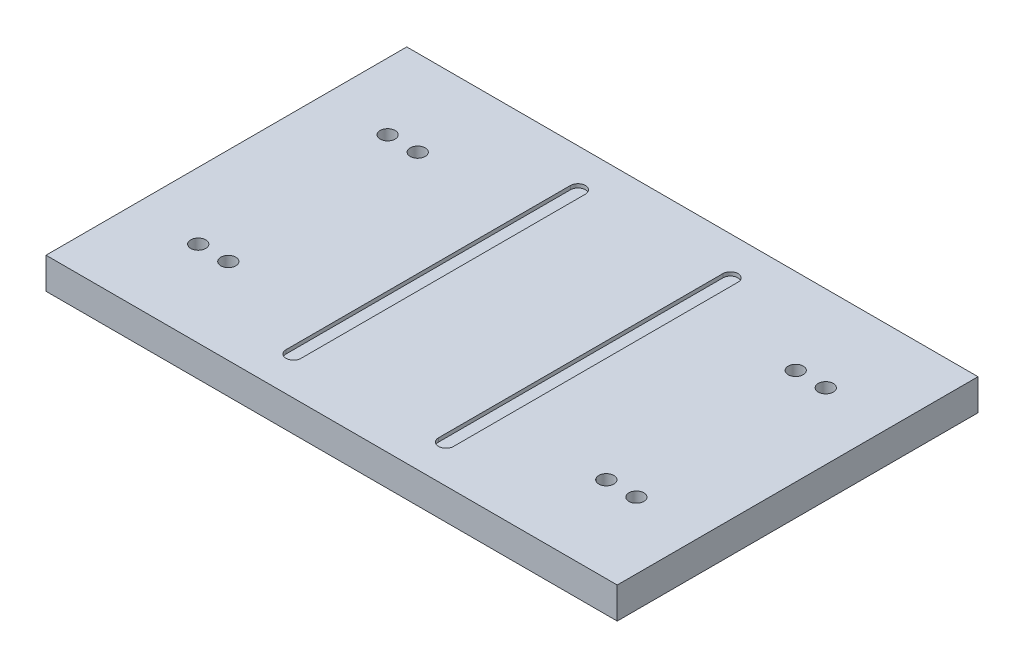
ISO-10303-21;
HEADER;
FILE_DESCRIPTION(('STEP AP214'),'2;1');
FILE_NAME('part.step','',(''),(''),'','','');
FILE_SCHEMA(('AUTOMOTIVE_DESIGN { 1 0 10303 214 1 1 1 1 }'));
ENDSEC;
DATA;
#1=APPLICATION_CONTEXT('core data for automotive mechanical design processes');
#2=APPLICATION_PROTOCOL_DEFINITION('international standard','automotive_design',2000,#1);
#3=PRODUCT_CONTEXT('',#1,'mechanical');
#4=PRODUCT('Part','Part','',(#3));
#5=PRODUCT_RELATED_PRODUCT_CATEGORY('part','',(#4));
#6=PRODUCT_DEFINITION_FORMATION('','',#4);
#7=PRODUCT_DEFINITION_CONTEXT('part definition',#1,'design');
#8=PRODUCT_DEFINITION('design','',#6,#7);
#9=PRODUCT_DEFINITION_SHAPE('','',#8);
#10=(LENGTH_UNIT() NAMED_UNIT(*) SI_UNIT(.MILLI.,.METRE.));
#11=(NAMED_UNIT(*) PLANE_ANGLE_UNIT() SI_UNIT($,.RADIAN.));
#12=(NAMED_UNIT(*) SI_UNIT($,.STERADIAN.) SOLID_ANGLE_UNIT());
#13=UNCERTAINTY_MEASURE_WITH_UNIT(LENGTH_MEASURE(1.E-05),#10,'distance_accuracy_value','');
#14=(GEOMETRIC_REPRESENTATION_CONTEXT(3) GLOBAL_UNCERTAINTY_ASSIGNED_CONTEXT((#13)) GLOBAL_UNIT_ASSIGNED_CONTEXT((#10,
#11,#12)) REPRESENTATION_CONTEXT('',''));
#15=CARTESIAN_POINT('',(0.,0.,0.));
#16=DIRECTION('',(0.,0.,1.));
#17=DIRECTION('',(1.,0.,0.));
#18=AXIS2_PLACEMENT_3D('',#15,#16,#17);
#19=CARTESIAN_POINT('',(0.,26.416,0.));
#20=DIRECTION('',(0.,-1.,0.));
#21=DIRECTION('',(0.,0.,-1.));
#22=AXIS2_PLACEMENT_3D('',#19,#20,#21);
#23=PLANE('',#22);
#24=CARTESIAN_POINT('',(159.6865,26.416,80.01));
#25=DIRECTION('',(0.,1.,0.));
#26=DIRECTION('',(0.,0.,-1.));
#27=AXIS2_PLACEMENT_3D('',#24,#25,#26);
#28=CIRCLE('',#27,6.34999999999999);
#29=CARTESIAN_POINT('',(159.6865,26.416,73.66));
#30=VERTEX_POINT('',#29);
#31=EDGE_CURVE('E584',#30,#30,#28,.T.);
#32=ORIENTED_EDGE('',*,*,#31,.F.);
#33=EDGE_LOOP('',(#32));
#34=FACE_BOUND('',#33,.T.);
#35=CARTESIAN_POINT('',(-185.0865,26.416,-80.01));
#36=DIRECTION('',(0.,1.,0.));
#37=DIRECTION('',(0.,0.,-1.));
#38=AXIS2_PLACEMENT_3D('',#35,#36,#37);
#39=CIRCLE('',#38,6.34999999999999);
#40=CARTESIAN_POINT('',(-185.0865,26.416,-86.36));
#41=VERTEX_POINT('',#40);
#42=EDGE_CURVE('E591',#41,#41,#39,.T.);
#43=ORIENTED_EDGE('',*,*,#42,.F.);
#44=EDGE_LOOP('',(#43));
#45=FACE_BOUND('',#44,.T.);
#46=CARTESIAN_POINT('',(-159.6865,26.416,-80.01));
#47=DIRECTION('',(0.,1.,0.));
#48=DIRECTION('',(0.,0.,-1.));
#49=AXIS2_PLACEMENT_3D('',#46,#47,#48);
#50=CIRCLE('',#49,6.34999999999999);
#51=CARTESIAN_POINT('',(-159.6865,26.416,-86.36));
#52=VERTEX_POINT('',#51);
#53=EDGE_CURVE('E605',#52,#52,#50,.T.);
#54=ORIENTED_EDGE('',*,*,#53,.F.);
#55=EDGE_LOOP('',(#54));
#56=FACE_BOUND('',#55,.T.);
#57=CARTESIAN_POINT('',(-159.6865,26.416,80.01));
#58=DIRECTION('',(0.,1.,0.));
#59=DIRECTION('',(0.,0.,1.));
#60=AXIS2_PLACEMENT_3D('',#57,#58,#59);
#61=CIRCLE('',#60,6.34999999999999);
#62=CARTESIAN_POINT('',(-159.6865,26.416,86.36));
#63=VERTEX_POINT('',#62);
#64=EDGE_CURVE('E597',#63,#63,#61,.T.);
#65=ORIENTED_EDGE('',*,*,#64,.F.);
#66=EDGE_LOOP('',(#65));
#67=FACE_BOUND('',#66,.T.);
#68=CARTESIAN_POINT('',(185.0865,26.416,-80.01));
#69=DIRECTION('',(0.,1.,0.));
#70=DIRECTION('',(0.,0.,1.));
#71=AXIS2_PLACEMENT_3D('',#68,#69,#70);
#72=CIRCLE('',#71,6.34999999999999);
#73=CARTESIAN_POINT('',(185.0865,26.416,-73.66));
#74=VERTEX_POINT('',#73);
#75=EDGE_CURVE('E634',#74,#74,#72,.T.);
#76=ORIENTED_EDGE('',*,*,#75,.F.);
#77=EDGE_LOOP('',(#76));
#78=FACE_BOUND('',#77,.T.);
#79=CARTESIAN_POINT('',(159.6865,26.416,-80.01));
#80=DIRECTION('',(0.,1.,0.));
#81=DIRECTION('',(0.,0.,1.));
#82=AXIS2_PLACEMENT_3D('',#79,#80,#81);
#83=CIRCLE('',#82,6.34999999999999);
#84=CARTESIAN_POINT('',(159.6865,26.416,-73.66));
#85=VERTEX_POINT('',#84);
#86=EDGE_CURVE('E633',#85,#85,#83,.T.);
#87=ORIENTED_EDGE('',*,*,#86,.F.);
#88=EDGE_LOOP('',(#87));
#89=FACE_BOUND('',#88,.T.);
#90=CARTESIAN_POINT('',(185.0865,26.416,80.01));
#91=DIRECTION('',(0.,1.,0.));
#92=DIRECTION('',(0.,0.,-1.));
#93=AXIS2_PLACEMENT_3D('',#90,#91,#92);
#94=CIRCLE('',#93,6.34999999999999);
#95=CARTESIAN_POINT('',(185.0865,26.416,73.66));
#96=VERTEX_POINT('',#95);
#97=EDGE_CURVE('E593',#96,#96,#94,.T.);
#98=ORIENTED_EDGE('',*,*,#97,.F.);
#99=EDGE_LOOP('',(#98));
#100=FACE_BOUND('',#99,.T.);
#101=CARTESIAN_POINT('',(-185.0865,26.416,80.01));
#102=DIRECTION('',(0.,1.,0.));
#103=DIRECTION('',(0.,0.,1.));
#104=AXIS2_PLACEMENT_3D('',#101,#102,#103);
#105=CIRCLE('',#104,6.34999999999999);
#106=CARTESIAN_POINT('',(-185.0865,26.416,86.36));
#107=VERTEX_POINT('',#106);
#108=EDGE_CURVE('E164',#107,#107,#105,.T.);
#109=ORIENTED_EDGE('',*,*,#108,.F.);
#110=EDGE_LOOP('',(#109));
#111=FACE_BOUND('',#110,.T.);
#112=DIRECTION('',(0.,0.,-1.));
#113=VECTOR('',#112,1.);
#114=CARTESIAN_POINT('',(-70.7865,26.416,0.));
#115=LINE('',#114,#113);
#116=CARTESIAN_POINT('',(-70.7865,26.416,120.142));
#117=VERTEX_POINT('',#116);
#118=CARTESIAN_POINT('',(-70.7865,26.416,-120.142));
#119=VERTEX_POINT('',#118);
#120=EDGE_CURVE('E173',#117,#119,#115,.T.);
#121=ORIENTED_EDGE('',*,*,#120,.T.);
#122=CARTESIAN_POINT('',(-64.4365,26.416,-120.142));
#123=DIRECTION('',(0.,1.,0.));
#124=DIRECTION('',(0.,0.,1.));
#125=AXIS2_PLACEMENT_3D('',#122,#123,#124);
#126=CIRCLE('',#125,6.35);
#127=CARTESIAN_POINT('',(-58.0865,26.416,-120.142));
#128=VERTEX_POINT('',#127);
#129=EDGE_CURVE('E59',#128,#119,#126,.T.);
#130=ORIENTED_EDGE('',*,*,#129,.F.);
#131=DIRECTION('',(0.,0.,-1.));
#132=VECTOR('',#131,1.);
#133=CARTESIAN_POINT('',(-58.0865,26.416,0.));
#134=LINE('',#133,#132);
#135=CARTESIAN_POINT('',(-58.0865,26.416,120.142));
#136=VERTEX_POINT('',#135);
#137=EDGE_CURVE('E157',#136,#128,#134,.T.);
#138=ORIENTED_EDGE('',*,*,#137,.F.);
#139=CARTESIAN_POINT('',(-64.4365,26.416,120.142));
#140=DIRECTION('',(0.,1.,0.));
#141=DIRECTION('',(0.,0.,1.));
#142=AXIS2_PLACEMENT_3D('',#139,#140,#141);
#143=CIRCLE('',#142,6.35);
#144=EDGE_CURVE('E161',#136,#117,#143,.F.);
#145=ORIENTED_EDGE('',*,*,#144,.T.);
#146=EDGE_LOOP('',(#121,#130,#138,#145));
#147=FACE_BOUND('',#146,.T.);
#148=DIRECTION('',(0.,0.,-1.));
#149=VECTOR('',#148,1.);
#150=CARTESIAN_POINT('',(241.3,26.416,152.4));
#151=LINE('',#150,#149);
#152=CARTESIAN_POINT('',(241.3,26.416,152.4));
#153=VERTEX_POINT('',#152);
#154=CARTESIAN_POINT('',(241.3,26.416,-152.4));
#155=VERTEX_POINT('',#154);
#156=EDGE_CURVE('E229',#153,#155,#151,.T.);
#157=ORIENTED_EDGE('',*,*,#156,.T.);
#158=DIRECTION('',(-1.,0.,0.));
#159=VECTOR('',#158,1.);
#160=CARTESIAN_POINT('',(-241.3,26.416,-152.4));
#161=LINE('',#160,#159);
#162=CARTESIAN_POINT('',(-241.3,26.416,-152.4));
#163=VERTEX_POINT('',#162);
#164=EDGE_CURVE('E233',#155,#163,#161,.T.);
#165=ORIENTED_EDGE('',*,*,#164,.T.);
#166=DIRECTION('',(0.,0.,1.));
#167=VECTOR('',#166,1.);
#168=CARTESIAN_POINT('',(-241.3,26.416,152.4));
#169=LINE('',#168,#167);
#170=CARTESIAN_POINT('',(-241.3,26.416,152.4));
#171=VERTEX_POINT('',#170);
#172=EDGE_CURVE('E237',#163,#171,#169,.T.);
#173=ORIENTED_EDGE('',*,*,#172,.T.);
#174=DIRECTION('',(1.,0.,0.));
#175=VECTOR('',#174,1.);
#176=CARTESIAN_POINT('',(-241.3,26.416,152.4));
#177=LINE('',#176,#175);
#178=EDGE_CURVE('E240',#171,#153,#177,.T.);
#179=ORIENTED_EDGE('',*,*,#178,.T.);
#180=EDGE_LOOP('',(#157,#165,#173,#179));
#181=FACE_BOUND('',#180,.T.);
#182=CARTESIAN_POINT('',(64.4365,26.416,-120.142));
#183=DIRECTION('',(0.,1.,0.));
#184=DIRECTION('',(0.,0.,1.));
#185=AXIS2_PLACEMENT_3D('',#182,#183,#184);
#186=CIRCLE('',#185,6.34999999999999);
#187=CARTESIAN_POINT('',(58.0865000000001,26.416,-120.142));
#188=VERTEX_POINT('',#187);
#189=CARTESIAN_POINT('',(70.7865,26.416,-120.142));
#190=VERTEX_POINT('',#189);
#191=EDGE_CURVE('E67',#188,#190,#186,.F.);
#192=ORIENTED_EDGE('',*,*,#191,.T.);
#193=DIRECTION('',(0.,0.,-1.));
#194=VECTOR('',#193,1.);
#195=CARTESIAN_POINT('',(70.7865,26.416,0.));
#196=LINE('',#195,#194);
#197=CARTESIAN_POINT('',(70.7865,26.416,120.142));
#198=VERTEX_POINT('',#197);
#199=EDGE_CURVE('E202',#198,#190,#196,.T.);
#200=ORIENTED_EDGE('',*,*,#199,.F.);
#201=CARTESIAN_POINT('',(64.4365000000001,26.416,120.142));
#202=DIRECTION('',(0.,1.,0.));
#203=DIRECTION('',(0.,0.,1.));
#204=AXIS2_PLACEMENT_3D('',#201,#202,#203);
#205=CIRCLE('',#204,6.34999999999999);
#206=CARTESIAN_POINT('',(58.0865000000001,26.416,120.142));
#207=VERTEX_POINT('',#206);
#208=EDGE_CURVE('E206',#207,#198,#205,.T.);
#209=ORIENTED_EDGE('',*,*,#208,.F.);
#210=DIRECTION('',(0.,0.,-1.));
#211=VECTOR('',#210,1.);
#212=CARTESIAN_POINT('',(58.0865000000001,26.416,0.));
#213=LINE('',#212,#211);
#214=EDGE_CURVE('E211',#207,#188,#213,.T.);
#215=ORIENTED_EDGE('',*,*,#214,.T.);
#216=EDGE_LOOP('',(#192,#200,#209,#215));
#217=FACE_BOUND('',#216,.T.);
#218=ADVANCED_FACE('F43',(#34,#45,#56,#67,#78,#89,#100,#111,#147,#181,#217),#23,.F.);
#219=CARTESIAN_POINT('',(241.3,26.416,152.4));
#220=DIRECTION('',(-1.,0.,0.));
#221=DIRECTION('',(0.,0.,1.));
#222=AXIS2_PLACEMENT_3D('',#219,#220,#221);
#223=PLANE('',#222);
#224=DIRECTION('',(0.,0.,-1.));
#225=VECTOR('',#224,1.);
#226=CARTESIAN_POINT('',(241.3,0.,152.4));
#227=LINE('',#226,#225);
#228=CARTESIAN_POINT('',(241.3,0.,152.4));
#229=VERTEX_POINT('',#228);
#230=CARTESIAN_POINT('',(241.3,0.,-152.4));
#231=VERTEX_POINT('',#230);
#232=EDGE_CURVE('E182',#229,#231,#227,.T.);
#233=ORIENTED_EDGE('',*,*,#232,.T.);
#234=DIRECTION('',(0.,-1.,0.));
#235=VECTOR('',#234,1.);
#236=CARTESIAN_POINT('',(241.3,26.416,-152.4));
#237=LINE('',#236,#235);
#238=EDGE_CURVE('E11',#155,#231,#237,.T.);
#239=ORIENTED_EDGE('',*,*,#238,.F.);
#240=ORIENTED_EDGE('',*,*,#156,.F.);
#241=DIRECTION('',(0.,-1.,0.));
#242=VECTOR('',#241,1.);
#243=CARTESIAN_POINT('',(241.3,26.416,152.4));
#244=LINE('',#243,#242);
#245=EDGE_CURVE('E243',#153,#229,#244,.T.);
#246=ORIENTED_EDGE('',*,*,#245,.T.);
#247=EDGE_LOOP('',(#233,#239,#240,#246));
#248=FACE_BOUND('',#247,.T.);
#249=ADVANCED_FACE('F45',(#248),#223,.F.);
#250=CARTESIAN_POINT('',(-241.3,26.416,-152.4));
#251=DIRECTION('',(0.,0.,1.));
#252=DIRECTION('',(1.,0.,0.));
#253=AXIS2_PLACEMENT_3D('',#250,#251,#252);
#254=PLANE('',#253);
#255=DIRECTION('',(-1.,0.,0.));
#256=VECTOR('',#255,1.);
#257=CARTESIAN_POINT('',(-241.3,0.,-152.4));
#258=LINE('',#257,#256);
#259=CARTESIAN_POINT('',(-241.3,0.,-152.4));
#260=VERTEX_POINT('',#259);
#261=EDGE_CURVE('E247',#231,#260,#258,.T.);
#262=ORIENTED_EDGE('',*,*,#261,.T.);
#263=DIRECTION('',(0.,-1.,0.));
#264=VECTOR('',#263,1.);
#265=CARTESIAN_POINT('',(-241.3,26.416,-152.4));
#266=LINE('',#265,#264);
#267=EDGE_CURVE('E52',#163,#260,#266,.T.);
#268=ORIENTED_EDGE('',*,*,#267,.F.);
#269=ORIENTED_EDGE('',*,*,#164,.F.);
#270=ORIENTED_EDGE('',*,*,#238,.T.);
#271=EDGE_LOOP('',(#262,#268,#269,#270));
#272=FACE_BOUND('',#271,.T.);
#273=ADVANCED_FACE('F283',(#272),#254,.F.);
#274=CARTESIAN_POINT('',(-241.3,26.416,152.4));
#275=DIRECTION('',(1.,0.,0.));
#276=DIRECTION('',(0.,0.,-1.));
#277=AXIS2_PLACEMENT_3D('',#274,#275,#276);
#278=PLANE('',#277);
#279=DIRECTION('',(0.,0.,1.));
#280=VECTOR('',#279,1.);
#281=CARTESIAN_POINT('',(-241.3,0.,152.4));
#282=LINE('',#281,#280);
#283=CARTESIAN_POINT('',(-241.3,0.,152.4));
#284=VERTEX_POINT('',#283);
#285=EDGE_CURVE('E250',#260,#284,#282,.T.);
#286=ORIENTED_EDGE('',*,*,#285,.T.);
#287=DIRECTION('',(0.,-1.,0.));
#288=VECTOR('',#287,1.);
#289=CARTESIAN_POINT('',(-241.3,26.416,152.4));
#290=LINE('',#289,#288);
#291=EDGE_CURVE('E258',#171,#284,#290,.T.);
#292=ORIENTED_EDGE('',*,*,#291,.F.);
#293=ORIENTED_EDGE('',*,*,#172,.F.);
#294=ORIENTED_EDGE('',*,*,#267,.T.);
#295=EDGE_LOOP('',(#286,#292,#293,#294));
#296=FACE_BOUND('',#295,.T.);
#297=ADVANCED_FACE('F267',(#296),#278,.F.);
#298=CARTESIAN_POINT('',(-241.3,26.416,152.4));
#299=DIRECTION('',(0.,0.,-1.));
#300=DIRECTION('',(-1.,0.,0.));
#301=AXIS2_PLACEMENT_3D('',#298,#299,#300);
#302=PLANE('',#301);
#303=DIRECTION('',(1.,0.,0.));
#304=VECTOR('',#303,1.);
#305=CARTESIAN_POINT('',(-241.3,0.,152.4));
#306=LINE('',#305,#304);
#307=EDGE_CURVE('E234',#284,#229,#306,.T.);
#308=ORIENTED_EDGE('',*,*,#307,.T.);
#309=ORIENTED_EDGE('',*,*,#245,.F.);
#310=ORIENTED_EDGE('',*,*,#178,.F.);
#311=ORIENTED_EDGE('',*,*,#291,.T.);
#312=EDGE_LOOP('',(#308,#309,#310,#311));
#313=FACE_BOUND('',#312,.T.);
#314=ADVANCED_FACE('F276',(#313),#302,.F.);
#315=CARTESIAN_POINT('',(0.,0.,0.));
#316=DIRECTION('',(0.,-1.,0.));
#317=DIRECTION('',(0.,0.,-1.));
#318=AXIS2_PLACEMENT_3D('',#315,#316,#317);
#319=PLANE('',#318);
#320=CARTESIAN_POINT('',(159.6865,0.,80.01));
#321=DIRECTION('',(0.,1.,0.));
#322=DIRECTION('',(0.,0.,-1.));
#323=AXIS2_PLACEMENT_3D('',#320,#321,#322);
#324=CIRCLE('',#323,6.34999999999999);
#325=CARTESIAN_POINT('',(159.6865,0.,73.66));
#326=VERTEX_POINT('',#325);
#327=EDGE_CURVE('E582',#326,#326,#324,.T.);
#328=ORIENTED_EDGE('',*,*,#327,.T.);
#329=EDGE_LOOP('',(#328));
#330=FACE_BOUND('',#329,.T.);
#331=CARTESIAN_POINT('',(-185.0865,0.,-80.01));
#332=DIRECTION('',(0.,1.,0.));
#333=DIRECTION('',(0.,0.,-1.));
#334=AXIS2_PLACEMENT_3D('',#331,#332,#333);
#335=CIRCLE('',#334,6.34999999999999);
#336=CARTESIAN_POINT('',(-185.0865,0.,-86.36));
#337=VERTEX_POINT('',#336);
#338=EDGE_CURVE('E586',#337,#337,#335,.T.);
#339=ORIENTED_EDGE('',*,*,#338,.T.);
#340=EDGE_LOOP('',(#339));
#341=FACE_BOUND('',#340,.T.);
#342=CARTESIAN_POINT('',(-159.6865,0.,-80.01));
#343=DIRECTION('',(0.,1.,0.));
#344=DIRECTION('',(0.,0.,-1.));
#345=AXIS2_PLACEMENT_3D('',#342,#343,#344);
#346=CIRCLE('',#345,6.34999999999999);
#347=CARTESIAN_POINT('',(-159.6865,0.,-86.36));
#348=VERTEX_POINT('',#347);
#349=EDGE_CURVE('E609',#348,#348,#346,.T.);
#350=ORIENTED_EDGE('',*,*,#349,.T.);
#351=EDGE_LOOP('',(#350));
#352=FACE_BOUND('',#351,.T.);
#353=CARTESIAN_POINT('',(-159.6865,0.,80.01));
#354=DIRECTION('',(0.,1.,0.));
#355=DIRECTION('',(0.,0.,1.));
#356=AXIS2_PLACEMENT_3D('',#353,#354,#355);
#357=CIRCLE('',#356,6.34999999999999);
#358=CARTESIAN_POINT('',(-159.6865,0.,86.36));
#359=VERTEX_POINT('',#358);
#360=EDGE_CURVE('E601',#359,#359,#357,.T.);
#361=ORIENTED_EDGE('',*,*,#360,.T.);
#362=EDGE_LOOP('',(#361));
#363=FACE_BOUND('',#362,.T.);
#364=CARTESIAN_POINT('',(185.0865,0.,-80.01));
#365=DIRECTION('',(0.,1.,0.));
#366=DIRECTION('',(0.,0.,1.));
#367=AXIS2_PLACEMENT_3D('',#364,#365,#366);
#368=CIRCLE('',#367,6.34999999999999);
#369=CARTESIAN_POINT('',(185.0865,0.,-73.66));
#370=VERTEX_POINT('',#369);
#371=EDGE_CURVE('E645',#370,#370,#368,.T.);
#372=ORIENTED_EDGE('',*,*,#371,.T.);
#373=EDGE_LOOP('',(#372));
#374=FACE_BOUND('',#373,.T.);
#375=CARTESIAN_POINT('',(159.6865,0.,-80.01));
#376=DIRECTION('',(0.,1.,0.));
#377=DIRECTION('',(0.,0.,1.));
#378=AXIS2_PLACEMENT_3D('',#375,#376,#377);
#379=CIRCLE('',#378,6.34999999999999);
#380=CARTESIAN_POINT('',(159.6865,0.,-73.66));
#381=VERTEX_POINT('',#380);
#382=EDGE_CURVE('E629',#381,#381,#379,.T.);
#383=ORIENTED_EDGE('',*,*,#382,.T.);
#384=EDGE_LOOP('',(#383));
#385=FACE_BOUND('',#384,.T.);
#386=CARTESIAN_POINT('',(185.0865,0.,80.01));
#387=DIRECTION('',(0.,1.,0.));
#388=DIRECTION('',(0.,0.,-1.));
#389=AXIS2_PLACEMENT_3D('',#386,#387,#388);
#390=CIRCLE('',#389,6.34999999999999);
#391=CARTESIAN_POINT('',(185.0865,0.,73.66));
#392=VERTEX_POINT('',#391);
#393=EDGE_CURVE('E638',#392,#392,#390,.T.);
#394=ORIENTED_EDGE('',*,*,#393,.T.);
#395=EDGE_LOOP('',(#394));
#396=FACE_BOUND('',#395,.T.);
#397=CARTESIAN_POINT('',(-185.0865,0.,80.01));
#398=DIRECTION('',(0.,1.,0.));
#399=DIRECTION('',(0.,0.,1.));
#400=AXIS2_PLACEMENT_3D('',#397,#398,#399);
#401=CIRCLE('',#400,6.34999999999999);
#402=CARTESIAN_POINT('',(-185.0865,0.,86.36));
#403=VERTEX_POINT('',#402);
#404=EDGE_CURVE('E201',#403,#403,#401,.T.);
#405=ORIENTED_EDGE('',*,*,#404,.T.);
#406=EDGE_LOOP('',(#405));
#407=FACE_BOUND('',#406,.T.);
#408=ORIENTED_EDGE('',*,*,#232,.F.);
#409=ORIENTED_EDGE('',*,*,#307,.F.);
#410=ORIENTED_EDGE('',*,*,#285,.F.);
#411=ORIENTED_EDGE('',*,*,#261,.F.);
#412=EDGE_LOOP('',(#408,#409,#410,#411));
#413=FACE_BOUND('',#412,.T.);
#414=ADVANCED_FACE('F273',(#330,#341,#352,#363,#374,#385,#396,#407,#413),#319,.T.);
#415=CARTESIAN_POINT('',(64.4365,23.241,-120.142));
#416=DIRECTION('',(0.,1.,0.));
#417=DIRECTION('',(0.,0.,1.));
#418=AXIS2_PLACEMENT_3D('',#415,#416,#417);
#419=CYLINDRICAL_SURFACE('',#418,6.34999999999999);
#420=ORIENTED_EDGE('',*,*,#191,.F.);
#421=DIRECTION('',(0.,1.,0.));
#422=VECTOR('',#421,1.);
#423=CARTESIAN_POINT('',(58.0865000000001,23.241,-120.142));
#424=LINE('',#423,#422);
#425=CARTESIAN_POINT('',(58.0865000000001,23.241,-120.142));
#426=VERTEX_POINT('',#425);
#427=EDGE_CURVE('E188',#426,#188,#424,.T.);
#428=ORIENTED_EDGE('',*,*,#427,.F.);
#429=CARTESIAN_POINT('',(64.4365,23.241,-120.142));
#430=DIRECTION('',(0.,1.,0.));
#431=DIRECTION('',(0.,0.,1.));
#432=AXIS2_PLACEMENT_3D('',#429,#430,#431);
#433=CIRCLE('',#432,6.34999999999999);
#434=CARTESIAN_POINT('',(70.7865,23.241,-120.142));
#435=VERTEX_POINT('',#434);
#436=EDGE_CURVE('E207',#426,#435,#433,.F.);
#437=ORIENTED_EDGE('',*,*,#436,.T.);
#438=DIRECTION('',(0.,1.,0.));
#439=VECTOR('',#438,1.);
#440=CARTESIAN_POINT('',(70.7865,23.241,-120.142));
#441=LINE('',#440,#439);
#442=EDGE_CURVE('E198',#435,#190,#441,.T.);
#443=ORIENTED_EDGE('',*,*,#442,.T.);
#444=EDGE_LOOP('',(#420,#428,#437,#443));
#445=FACE_BOUND('',#444,.T.);
#446=ADVANCED_FACE('F303',(#445),#419,.F.);
#447=CARTESIAN_POINT('',(70.7865,23.241,0.));
#448=DIRECTION('',(1.,0.,0.));
#449=DIRECTION('',(0.,0.,-1.));
#450=AXIS2_PLACEMENT_3D('',#447,#448,#449);
#451=PLANE('',#450);
#452=ORIENTED_EDGE('',*,*,#199,.T.);
#453=ORIENTED_EDGE('',*,*,#442,.F.);
#454=DIRECTION('',(0.,0.,-1.));
#455=VECTOR('',#454,1.);
#456=CARTESIAN_POINT('',(70.7865,23.241,0.));
#457=LINE('',#456,#455);
#458=CARTESIAN_POINT('',(70.7865,23.241,120.142));
#459=VERTEX_POINT('',#458);
#460=EDGE_CURVE('E191',#459,#435,#457,.T.);
#461=ORIENTED_EDGE('',*,*,#460,.F.);
#462=DIRECTION('',(0.,1.,0.));
#463=VECTOR('',#462,1.);
#464=CARTESIAN_POINT('',(70.7865,23.241,120.142));
#465=LINE('',#464,#463);
#466=EDGE_CURVE('E195',#459,#198,#465,.T.);
#467=ORIENTED_EDGE('',*,*,#466,.T.);
#468=EDGE_LOOP('',(#452,#453,#461,#467));
#469=FACE_BOUND('',#468,.T.);
#470=ADVANCED_FACE('F321',(#469),#451,.F.);
#471=CARTESIAN_POINT('',(64.4365000000001,23.241,120.142));
#472=DIRECTION('',(0.,1.,0.));
#473=DIRECTION('',(0.,0.,1.));
#474=AXIS2_PLACEMENT_3D('',#471,#472,#473);
#475=CYLINDRICAL_SURFACE('',#474,6.34999999999999);
#476=ORIENTED_EDGE('',*,*,#208,.T.);
#477=ORIENTED_EDGE('',*,*,#466,.F.);
#478=CARTESIAN_POINT('',(64.4365000000001,23.241,120.142));
#479=DIRECTION('',(0.,1.,0.));
#480=DIRECTION('',(0.,0.,1.));
#481=AXIS2_PLACEMENT_3D('',#478,#479,#480);
#482=CIRCLE('',#481,6.34999999999999);
#483=CARTESIAN_POINT('',(58.0865000000001,23.241,120.142));
#484=VERTEX_POINT('',#483);
#485=EDGE_CURVE('E220',#484,#459,#482,.T.);
#486=ORIENTED_EDGE('',*,*,#485,.F.);
#487=DIRECTION('',(0.,1.,0.));
#488=VECTOR('',#487,1.);
#489=CARTESIAN_POINT('',(58.0865000000001,23.241,120.142));
#490=LINE('',#489,#488);
#491=EDGE_CURVE('E192',#484,#207,#490,.T.);
#492=ORIENTED_EDGE('',*,*,#491,.T.);
#493=EDGE_LOOP('',(#476,#477,#486,#492));
#494=FACE_BOUND('',#493,.T.);
#495=ADVANCED_FACE('F328',(#494),#475,.F.);
#496=CARTESIAN_POINT('',(58.0865000000001,23.241,0.));
#497=DIRECTION('',(1.,0.,0.));
#498=DIRECTION('',(0.,0.,-1.));
#499=AXIS2_PLACEMENT_3D('',#496,#497,#498);
#500=PLANE('',#499);
#501=ORIENTED_EDGE('',*,*,#214,.F.);
#502=ORIENTED_EDGE('',*,*,#491,.F.);
#503=DIRECTION('',(0.,0.,-1.));
#504=VECTOR('',#503,1.);
#505=CARTESIAN_POINT('',(58.0865000000001,23.241,0.));
#506=LINE('',#505,#504);
#507=EDGE_CURVE('E224',#484,#426,#506,.T.);
#508=ORIENTED_EDGE('',*,*,#507,.T.);
#509=ORIENTED_EDGE('',*,*,#427,.T.);
#510=EDGE_LOOP('',(#501,#502,#508,#509));
#511=FACE_BOUND('',#510,.T.);
#512=ADVANCED_FACE('F335',(#511),#500,.T.);
#513=CARTESIAN_POINT('',(0.,23.241,0.));
#514=DIRECTION('',(0.,1.,0.));
#515=DIRECTION('',(0.,0.,1.));
#516=AXIS2_PLACEMENT_3D('',#513,#514,#515);
#517=PLANE('',#516);
#518=ORIENTED_EDGE('',*,*,#436,.F.);
#519=ORIENTED_EDGE('',*,*,#507,.F.);
#520=ORIENTED_EDGE('',*,*,#485,.T.);
#521=ORIENTED_EDGE('',*,*,#460,.T.);
#522=EDGE_LOOP('',(#518,#519,#520,#521));
#523=FACE_BOUND('',#522,.T.);
#524=ADVANCED_FACE('F299',(#523),#517,.T.);
#525=CARTESIAN_POINT('',(-64.4365,23.241,-120.142));
#526=DIRECTION('',(0.,1.,0.));
#527=DIRECTION('',(0.,0.,1.));
#528=AXIS2_PLACEMENT_3D('',#525,#526,#527);
#529=CYLINDRICAL_SURFACE('',#528,6.35);
#530=ORIENTED_EDGE('',*,*,#129,.T.);
#531=DIRECTION('',(0.,1.,0.));
#532=VECTOR('',#531,1.);
#533=CARTESIAN_POINT('',(-70.7865,23.241,-120.142));
#534=LINE('',#533,#532);
#535=CARTESIAN_POINT('',(-70.7865,23.241,-120.142));
#536=VERTEX_POINT('',#535);
#537=EDGE_CURVE('E138',#536,#119,#534,.T.);
#538=ORIENTED_EDGE('',*,*,#537,.F.);
#539=CARTESIAN_POINT('',(-64.4365,23.241,-120.142));
#540=DIRECTION('',(0.,1.,0.));
#541=DIRECTION('',(0.,0.,1.));
#542=AXIS2_PLACEMENT_3D('',#539,#540,#541);
#543=CIRCLE('',#542,6.35);
#544=CARTESIAN_POINT('',(-58.0865,23.241,-120.142));
#545=VERTEX_POINT('',#544);
#546=EDGE_CURVE('E146',#545,#536,#543,.T.);
#547=ORIENTED_EDGE('',*,*,#546,.F.);
#548=DIRECTION('',(0.,1.,0.));
#549=VECTOR('',#548,1.);
#550=CARTESIAN_POINT('',(-58.0865,23.241,-120.142));
#551=LINE('',#550,#549);
#552=EDGE_CURVE('E179',#545,#128,#551,.T.);
#553=ORIENTED_EDGE('',*,*,#552,.T.);
#554=EDGE_LOOP('',(#530,#538,#547,#553));
#555=FACE_BOUND('',#554,.T.);
#556=ADVANCED_FACE('F149',(#555),#529,.F.);
#557=CARTESIAN_POINT('',(-58.0865,23.241,0.));
#558=DIRECTION('',(1.,0.,0.));
#559=DIRECTION('',(0.,0.,-1.));
#560=AXIS2_PLACEMENT_3D('',#557,#558,#559);
#561=PLANE('',#560);
#562=ORIENTED_EDGE('',*,*,#137,.T.);
#563=ORIENTED_EDGE('',*,*,#552,.F.);
#564=DIRECTION('',(0.,0.,-1.));
#565=VECTOR('',#564,1.);
#566=CARTESIAN_POINT('',(-58.0865,23.241,0.));
#567=LINE('',#566,#565);
#568=CARTESIAN_POINT('',(-58.0865,23.241,120.142));
#569=VERTEX_POINT('',#568);
#570=EDGE_CURVE('E152',#569,#545,#567,.T.);
#571=ORIENTED_EDGE('',*,*,#570,.F.);
#572=DIRECTION('',(0.,1.,0.));
#573=VECTOR('',#572,1.);
#574=CARTESIAN_POINT('',(-58.0865,23.241,120.142));
#575=LINE('',#574,#573);
#576=EDGE_CURVE('E183',#569,#136,#575,.T.);
#577=ORIENTED_EDGE('',*,*,#576,.T.);
#578=EDGE_LOOP('',(#562,#563,#571,#577));
#579=FACE_BOUND('',#578,.T.);
#580=ADVANCED_FACE('F356',(#579),#561,.F.);
#581=CARTESIAN_POINT('',(-64.4365,23.241,120.142));
#582=DIRECTION('',(0.,1.,0.));
#583=DIRECTION('',(0.,0.,1.));
#584=AXIS2_PLACEMENT_3D('',#581,#582,#583);
#585=CYLINDRICAL_SURFACE('',#584,6.35);
#586=ORIENTED_EDGE('',*,*,#144,.F.);
#587=ORIENTED_EDGE('',*,*,#576,.F.);
#588=CARTESIAN_POINT('',(-64.4365,23.241,120.142));
#589=DIRECTION('',(0.,1.,0.));
#590=DIRECTION('',(0.,0.,1.));
#591=AXIS2_PLACEMENT_3D('',#588,#589,#590);
#592=CIRCLE('',#591,6.35);
#593=CARTESIAN_POINT('',(-70.7865,23.241,120.142));
#594=VERTEX_POINT('',#593);
#595=EDGE_CURVE('E145',#569,#594,#592,.F.);
#596=ORIENTED_EDGE('',*,*,#595,.T.);
#597=DIRECTION('',(0.,1.,0.));
#598=VECTOR('',#597,1.);
#599=CARTESIAN_POINT('',(-70.7865,23.241,120.142));
#600=LINE('',#599,#598);
#601=EDGE_CURVE('E140',#594,#117,#600,.T.);
#602=ORIENTED_EDGE('',*,*,#601,.T.);
#603=EDGE_LOOP('',(#586,#587,#596,#602));
#604=FACE_BOUND('',#603,.T.);
#605=ADVANCED_FACE('F363',(#604),#585,.F.);
#606=CARTESIAN_POINT('',(-70.7865,23.241,0.));
#607=DIRECTION('',(1.,0.,0.));
#608=DIRECTION('',(0.,0.,-1.));
#609=AXIS2_PLACEMENT_3D('',#606,#607,#608);
#610=PLANE('',#609);
#611=ORIENTED_EDGE('',*,*,#120,.F.);
#612=ORIENTED_EDGE('',*,*,#601,.F.);
#613=DIRECTION('',(0.,0.,-1.));
#614=VECTOR('',#613,1.);
#615=CARTESIAN_POINT('',(-70.7865,23.241,0.));
#616=LINE('',#615,#614);
#617=EDGE_CURVE('E135',#594,#536,#616,.T.);
#618=ORIENTED_EDGE('',*,*,#617,.T.);
#619=ORIENTED_EDGE('',*,*,#537,.T.);
#620=EDGE_LOOP('',(#611,#612,#618,#619));
#621=FACE_BOUND('',#620,.T.);
#622=ADVANCED_FACE('F137',(#621),#610,.T.);
#623=CARTESIAN_POINT('',(0.,23.241,0.));
#624=DIRECTION('',(0.,1.,0.));
#625=DIRECTION('',(0.,0.,1.));
#626=AXIS2_PLACEMENT_3D('',#623,#624,#625);
#627=PLANE('',#626);
#628=ORIENTED_EDGE('',*,*,#546,.T.);
#629=ORIENTED_EDGE('',*,*,#617,.F.);
#630=ORIENTED_EDGE('',*,*,#595,.F.);
#631=ORIENTED_EDGE('',*,*,#570,.T.);
#632=EDGE_LOOP('',(#628,#629,#630,#631));
#633=FACE_BOUND('',#632,.T.);
#634=ADVANCED_FACE('F154',(#633),#627,.T.);
#635=CARTESIAN_POINT('',(-185.0865,0.,80.01));
#636=DIRECTION('',(0.,1.,0.));
#637=DIRECTION('',(0.,0.,1.));
#638=AXIS2_PLACEMENT_3D('',#635,#636,#637);
#639=CYLINDRICAL_SURFACE('',#638,6.34999999999999);
#640=ORIENTED_EDGE('',*,*,#404,.F.);
#641=EDGE_LOOP('',(#640));
#642=FACE_BOUND('',#641,.T.);
#643=ORIENTED_EDGE('',*,*,#108,.T.);
#644=EDGE_LOOP('',(#643));
#645=FACE_BOUND('',#644,.T.);
#646=ADVANCED_FACE('F384',(#642,#645),#639,.F.);
#647=CARTESIAN_POINT('',(185.0865,0.,80.01));
#648=DIRECTION('',(0.,1.,0.));
#649=DIRECTION('',(0.,0.,1.));
#650=AXIS2_PLACEMENT_3D('',#647,#648,#649);
#651=CYLINDRICAL_SURFACE('',#650,6.34999999999999);
#652=ORIENTED_EDGE('',*,*,#393,.F.);
#653=EDGE_LOOP('',(#652));
#654=FACE_BOUND('',#653,.T.);
#655=ORIENTED_EDGE('',*,*,#97,.T.);
#656=EDGE_LOOP('',(#655));
#657=FACE_BOUND('',#656,.T.);
#658=ADVANCED_FACE('F390',(#654,#657),#651,.F.);
#659=CARTESIAN_POINT('',(159.6865,0.,-80.01));
#660=DIRECTION('',(0.,1.,0.));
#661=DIRECTION('',(0.,0.,1.));
#662=AXIS2_PLACEMENT_3D('',#659,#660,#661);
#663=CYLINDRICAL_SURFACE('',#662,6.34999999999999);
#664=ORIENTED_EDGE('',*,*,#382,.F.);
#665=EDGE_LOOP('',(#664));
#666=FACE_BOUND('',#665,.T.);
#667=ORIENTED_EDGE('',*,*,#86,.T.);
#668=EDGE_LOOP('',(#667));
#669=FACE_BOUND('',#668,.T.);
#670=ADVANCED_FACE('F398',(#666,#669),#663,.F.);
#671=CARTESIAN_POINT('',(185.0865,0.,-80.01));
#672=DIRECTION('',(0.,1.,0.));
#673=DIRECTION('',(0.,0.,1.));
#674=AXIS2_PLACEMENT_3D('',#671,#672,#673);
#675=CYLINDRICAL_SURFACE('',#674,6.34999999999999);
#676=ORIENTED_EDGE('',*,*,#371,.F.);
#677=EDGE_LOOP('',(#676));
#678=FACE_BOUND('',#677,.T.);
#679=ORIENTED_EDGE('',*,*,#75,.T.);
#680=EDGE_LOOP('',(#679));
#681=FACE_BOUND('',#680,.T.);
#682=ADVANCED_FACE('F406',(#678,#681),#675,.F.);
#683=CARTESIAN_POINT('',(-159.6865,0.,80.01));
#684=DIRECTION('',(0.,1.,0.));
#685=DIRECTION('',(0.,0.,1.));
#686=AXIS2_PLACEMENT_3D('',#683,#684,#685);
#687=CYLINDRICAL_SURFACE('',#686,6.34999999999999);
#688=ORIENTED_EDGE('',*,*,#360,.F.);
#689=EDGE_LOOP('',(#688));
#690=FACE_BOUND('',#689,.T.);
#691=ORIENTED_EDGE('',*,*,#64,.T.);
#692=EDGE_LOOP('',(#691));
#693=FACE_BOUND('',#692,.T.);
#694=ADVANCED_FACE('F414',(#690,#693),#687,.F.);
#695=CARTESIAN_POINT('',(-159.6865,0.,-80.01));
#696=DIRECTION('',(0.,1.,0.));
#697=DIRECTION('',(0.,0.,1.));
#698=AXIS2_PLACEMENT_3D('',#695,#696,#697);
#699=CYLINDRICAL_SURFACE('',#698,6.34999999999999);
#700=ORIENTED_EDGE('',*,*,#349,.F.);
#701=EDGE_LOOP('',(#700));
#702=FACE_BOUND('',#701,.T.);
#703=ORIENTED_EDGE('',*,*,#53,.T.);
#704=EDGE_LOOP('',(#703));
#705=FACE_BOUND('',#704,.T.);
#706=ADVANCED_FACE('F422',(#702,#705),#699,.F.);
#707=CARTESIAN_POINT('',(-185.0865,0.,-80.01));
#708=DIRECTION('',(0.,1.,0.));
#709=DIRECTION('',(0.,0.,1.));
#710=AXIS2_PLACEMENT_3D('',#707,#708,#709);
#711=CYLINDRICAL_SURFACE('',#710,6.34999999999999);
#712=ORIENTED_EDGE('',*,*,#338,.F.);
#713=EDGE_LOOP('',(#712));
#714=FACE_BOUND('',#713,.T.);
#715=ORIENTED_EDGE('',*,*,#42,.T.);
#716=EDGE_LOOP('',(#715));
#717=FACE_BOUND('',#716,.T.);
#718=ADVANCED_FACE('F430',(#714,#717),#711,.F.);
#719=CARTESIAN_POINT('',(159.6865,0.,80.01));
#720=DIRECTION('',(0.,1.,0.));
#721=DIRECTION('',(0.,0.,1.));
#722=AXIS2_PLACEMENT_3D('',#719,#720,#721);
#723=CYLINDRICAL_SURFACE('',#722,6.34999999999999);
#724=ORIENTED_EDGE('',*,*,#327,.F.);
#725=EDGE_LOOP('',(#724));
#726=FACE_BOUND('',#725,.T.);
#727=ORIENTED_EDGE('',*,*,#31,.T.);
#728=EDGE_LOOP('',(#727));
#729=FACE_BOUND('',#728,.T.);
#730=ADVANCED_FACE('F438',(#726,#729),#723,.F.);
#731=CLOSED_SHELL('',(#218,#249,#273,#297,#314,#414,#446,#470,#495,#512,#524,#556,#580,#605,
#622,#634,#646,#658,#670,#682,#694,#706,#718,#730));
#732=MANIFOLD_SOLID_BREP('B2',#731);
#733=ADVANCED_BREP_SHAPE_REPRESENTATION('',(#18,#732),#14);
#734=SHAPE_DEFINITION_REPRESENTATION(#9,#733);
ENDSEC;
END-ISO-10303-21;
